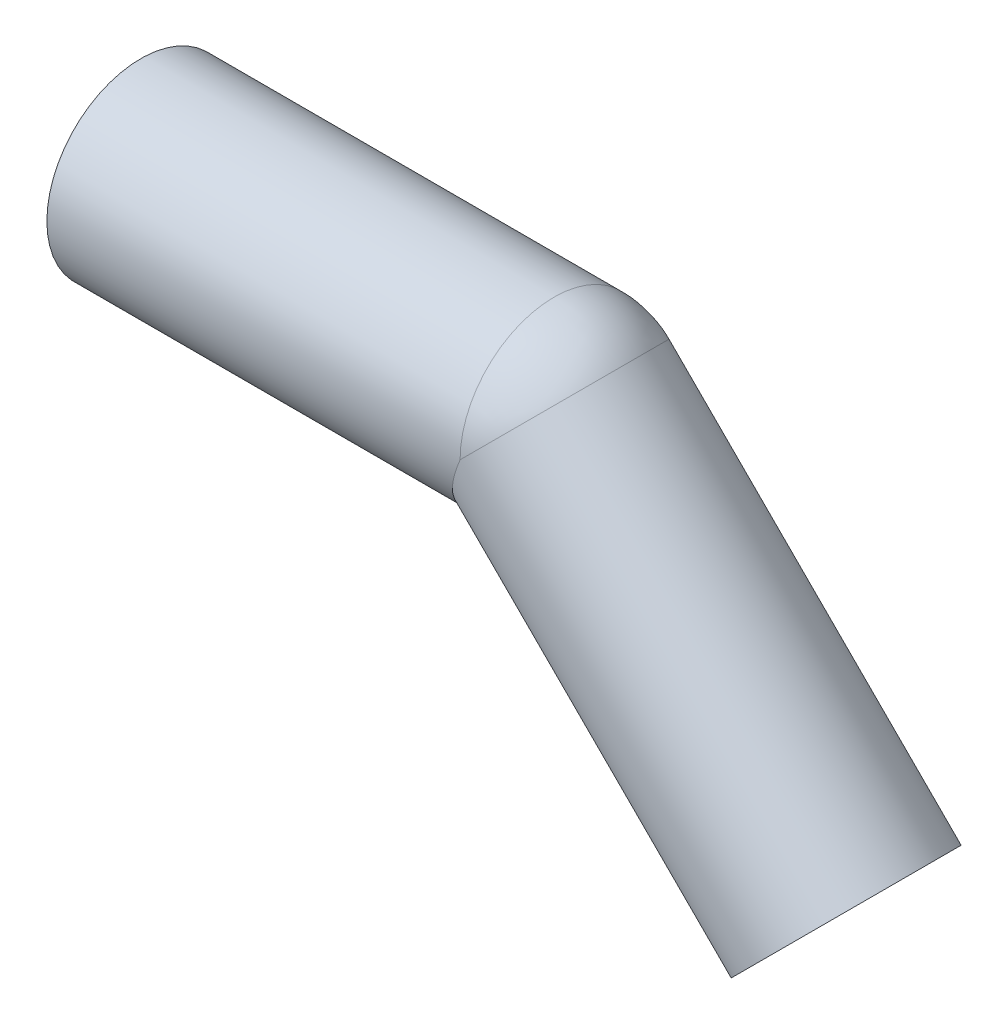
ISO-10303-21;
HEADER;
FILE_DESCRIPTION(('STEP AP214'),'2;1');
FILE_NAME('part.step','',(''),(''),'','','');
FILE_SCHEMA(('AUTOMOTIVE_DESIGN { 1 0 10303 214 1 1 1 1 }'));
ENDSEC;
DATA;
#1=APPLICATION_CONTEXT('core data for automotive mechanical design processes');
#2=APPLICATION_PROTOCOL_DEFINITION('international standard','automotive_design',2000,#1);
#3=PRODUCT_CONTEXT('',#1,'mechanical');
#4=PRODUCT('Part','Part','',(#3));
#5=PRODUCT_RELATED_PRODUCT_CATEGORY('part','',(#4));
#6=PRODUCT_DEFINITION_FORMATION('','',#4);
#7=PRODUCT_DEFINITION_CONTEXT('part definition',#1,'design');
#8=PRODUCT_DEFINITION('design','',#6,#7);
#9=PRODUCT_DEFINITION_SHAPE('','',#8);
#10=(LENGTH_UNIT() NAMED_UNIT(*) SI_UNIT(.MILLI.,.METRE.));
#11=(NAMED_UNIT(*) PLANE_ANGLE_UNIT() SI_UNIT($,.RADIAN.));
#12=(NAMED_UNIT(*) SI_UNIT($,.STERADIAN.) SOLID_ANGLE_UNIT());
#13=UNCERTAINTY_MEASURE_WITH_UNIT(LENGTH_MEASURE(1.E-05),#10,'distance_accuracy_value','');
#14=(GEOMETRIC_REPRESENTATION_CONTEXT(3) GLOBAL_UNCERTAINTY_ASSIGNED_CONTEXT((#13)) GLOBAL_UNIT_ASSIGNED_CONTEXT((#10,
#11,#12)) REPRESENTATION_CONTEXT('',''));
#15=CARTESIAN_POINT('',(0.,0.,0.));
#16=DIRECTION('',(0.,0.,1.));
#17=DIRECTION('',(1.,0.,0.));
#18=AXIS2_PLACEMENT_3D('',#15,#16,#17);
#19=CARTESIAN_POINT('',(75.1126983722081,-31.1126983722081,0.));
#20=DIRECTION('',(-0.707106781186548,0.707106781186547,0.));
#21=DIRECTION('',(-0.707106781186547,-0.707106781186548,0.));
#22=AXIS2_PLACEMENT_3D('',#19,#20,#21);
#23=CYLINDRICAL_SURFACE('',#22,8.10000000000003);
#24=CARTESIAN_POINT('',(44.,0.,0.));
#25=DIRECTION('',(0.707106781186547,-0.707106781186548,0.));
#26=DIRECTION('',(0.,0.,-1.));
#27=AXIS2_PLACEMENT_3D('',#24,#25,#26);
#28=CIRCLE('',#27,8.10000000000001);
#29=CARTESIAN_POINT('',(49.7275649276471,5.727564927575,0.));
#30=VERTEX_POINT('',#29);
#31=CARTESIAN_POINT('',(43.9999999999999,0.,8.10000000000002));
#32=VERTEX_POINT('',#31);
#33=EDGE_CURVE('E53',#30,#32,#28,.T.);
#34=ORIENTED_EDGE('',*,*,#33,.F.);
#35=CARTESIAN_POINT('',(44.,0.,0.));
#36=DIRECTION('',(0.707106781173201,-0.707106781199895,0.));
#37=DIRECTION('',(0.,0.,-1.));
#38=AXIS2_PLACEMENT_3D('',#35,#36,#37);
#39=CIRCLE('',#38,8.10000000000001);
#40=CARTESIAN_POINT('',(43.9999999999999,0.,-8.10000000000001));
#41=VERTEX_POINT('',#40);
#42=EDGE_CURVE('E46',#41,#30,#39,.T.);
#43=ORIENTED_EDGE('',*,*,#42,.F.);
#44=CARTESIAN_POINT('',(43.9999999999999,0.,0.));
#45=DIRECTION('',(-0.923879532511287,0.382683432365089,0.));
#46=DIRECTION('',(-0.382683432365089,-0.923879532511287,0.));
#47=AXIS2_PLACEMENT_3D('',#44,#45,#46);
#48=ELLIPSE('',#47,8.76737682236841,8.10000000000002);
#49=EDGE_CURVE('E55',#32,#41,#48,.F.);
#50=ORIENTED_EDGE('',*,*,#49,.F.);
#51=EDGE_LOOP('',(#34,#43,#50));
#52=FACE_BOUND('',#51,.T.);
#53=CARTESIAN_POINT('',(75.1126983722081,-31.1126983722081,0.));
#54=DIRECTION('',(-0.707106781186549,0.707106781186546,0.));
#55=DIRECTION('',(-0.707106781186546,-0.707106781186549,0.));
#56=AXIS2_PLACEMENT_3D('',#53,#54,#55);
#57=CIRCLE('',#56,8.10000000000003);
#58=CARTESIAN_POINT('',(69.385133444597,-36.8402632998192,0.));
#59=VERTEX_POINT('',#58);
#60=EDGE_CURVE('E18',#59,#59,#57,.T.);
#61=ORIENTED_EDGE('',*,*,#60,.F.);
#62=EDGE_LOOP('',(#61));
#63=FACE_BOUND('',#62,.T.);
#64=ADVANCED_FACE('F15',(#52,#63),#23,.F.);
#65=CARTESIAN_POINT('',(44.,0.,0.));
#66=DIRECTION('',(0.,0.,1.));
#67=DIRECTION('',(-1.,0.,0.));
#68=AXIS2_PLACEMENT_3D('',#65,#66,#67);
#69=SPHERICAL_SURFACE('',#68,8.10000000000001);
#70=CARTESIAN_POINT('',(44.,0.,0.));
#71=DIRECTION('',(-1.,0.,0.));
#72=DIRECTION('',(0.,1.,0.));
#73=AXIS2_PLACEMENT_3D('',#70,#71,#72);
#74=CIRCLE('',#73,8.1);
#75=EDGE_CURVE('E51',#41,#32,#74,.F.);
#76=ORIENTED_EDGE('',*,*,#75,.F.);
#77=ORIENTED_EDGE('',*,*,#42,.T.);
#78=ORIENTED_EDGE('',*,*,#33,.T.);
#79=EDGE_LOOP('',(#76,#77,#78));
#80=FACE_BOUND('',#79,.T.);
#81=ADVANCED_FACE('F58',(#80),#69,.F.);
#82=CARTESIAN_POINT('',(82.1837661840742,-24.041630560342,10.1200021082712));
#83=DIRECTION('',(0.707106781186547,-0.707106781186547,0.));
#84=DIRECTION('',(-0.707106781186547,-0.707106781186547,0.));
#85=AXIS2_PLACEMENT_3D('',#82,#83,#84);
#86=PLANE('',#85);
#87=ORIENTED_EDGE('',*,*,#60,.T.);
#88=EDGE_LOOP('',(#87));
#89=FACE_BOUND('',#88,.T.);
#90=CARTESIAN_POINT('',(75.1126983722082,-31.112698372208,0.));
#91=DIRECTION('',(-0.707106781186551,0.707106781186544,0.));
#92=DIRECTION('',(-0.707106781186544,-0.707106781186551,0.));
#93=AXIS2_PLACEMENT_3D('',#90,#91,#92);
#94=CIRCLE('',#93,10.);
#95=CARTESIAN_POINT('',(68.0416305603428,-38.1837661840736,0.));
#96=VERTEX_POINT('',#95);
#97=EDGE_CURVE('E71',#96,#96,#94,.T.);
#98=ORIENTED_EDGE('',*,*,#97,.F.);
#99=EDGE_LOOP('',(#98));
#100=FACE_BOUND('',#99,.T.);
#101=ADVANCED_FACE('F80',(#89,#100),#86,.T.);
#102=CARTESIAN_POINT('',(44.,0.,0.));
#103=DIRECTION('',(-1.,0.,0.));
#104=DIRECTION('',(0.,0.,1.));
#105=AXIS2_PLACEMENT_3D('',#102,#103,#104);
#106=CYLINDRICAL_SURFACE('',#105,8.1);
#107=CARTESIAN_POINT('',(0.,0.,0.));
#108=DIRECTION('',(-1.,0.,0.));
#109=DIRECTION('',(0.,0.,1.));
#110=AXIS2_PLACEMENT_3D('',#107,#108,#109);
#111=CIRCLE('',#110,8.1);
#112=CARTESIAN_POINT('',(0.,0.,8.1));
#113=VERTEX_POINT('',#112);
#114=EDGE_CURVE('E68',#113,#113,#111,.F.);
#115=ORIENTED_EDGE('',*,*,#114,.F.);
#116=EDGE_LOOP('',(#115));
#117=FACE_BOUND('',#116,.T.);
#118=ORIENTED_EDGE('',*,*,#49,.T.);
#119=ORIENTED_EDGE('',*,*,#75,.T.);
#120=EDGE_LOOP('',(#118,#119));
#121=FACE_BOUND('',#120,.T.);
#122=ADVANCED_FACE('F83',(#117,#121),#106,.F.);
#123=CARTESIAN_POINT('',(44.,0.,0.));
#124=DIRECTION('',(0.,0.,1.));
#125=DIRECTION('',(1.,0.,0.));
#126=AXIS2_PLACEMENT_3D('',#123,#124,#125);
#127=SPHERICAL_SURFACE('',#126,10.);
#128=CARTESIAN_POINT('',(44.,0.,0.));
#129=DIRECTION('',(-1.,0.,0.));
#130=DIRECTION('',(0.,1.,0.));
#131=AXIS2_PLACEMENT_3D('',#128,#129,#130);
#132=CIRCLE('',#131,10.);
#133=CARTESIAN_POINT('',(43.9999999999999,0.,10.));
#134=VERTEX_POINT('',#133);
#135=CARTESIAN_POINT('',(43.9999999999999,0.,-10.));
#136=VERTEX_POINT('',#135);
#137=EDGE_CURVE('E67',#134,#136,#132,.T.);
#138=ORIENTED_EDGE('',*,*,#137,.F.);
#139=CARTESIAN_POINT('',(44.,0.,0.));
#140=DIRECTION('',(-0.707106781178578,0.707106781194517,0.));
#141=DIRECTION('',(0.,0.,1.));
#142=AXIS2_PLACEMENT_3D('',#139,#140,#141);
#143=CIRCLE('',#142,10.);
#144=CARTESIAN_POINT('',(51.0710678119053,7.07106781182564,0.));
#145=VERTEX_POINT('',#144);
#146=EDGE_CURVE('E73',#134,#145,#143,.T.);
#147=ORIENTED_EDGE('',*,*,#146,.T.);
#148=CARTESIAN_POINT('',(43.9999999999999,0.,0.));
#149=DIRECTION('',(-0.707106781186551,0.707106781186544,0.));
#150=DIRECTION('',(0.707106781186544,0.707106781186551,0.));
#151=AXIS2_PLACEMENT_3D('',#148,#149,#150);
#152=CIRCLE('',#151,10.0000000000001);
#153=EDGE_CURVE('E33',#136,#145,#152,.F.);
#154=ORIENTED_EDGE('',*,*,#153,.F.);
#155=EDGE_LOOP('',(#138,#147,#154));
#156=FACE_BOUND('',#155,.T.);
#157=ADVANCED_FACE('F87',(#156),#127,.T.);
#158=CARTESIAN_POINT('',(43.9999999999999,0.,0.));
#159=DIRECTION('',(-0.707106781186551,0.707106781186544,0.));
#160=DIRECTION('',(-0.707106781186544,-0.707106781186551,0.));
#161=AXIS2_PLACEMENT_3D('',#158,#159,#160);
#162=CYLINDRICAL_SURFACE('',#161,10.);
#163=ORIENTED_EDGE('',*,*,#97,.T.);
#164=EDGE_LOOP('',(#163));
#165=FACE_BOUND('',#164,.T.);
#166=CARTESIAN_POINT('',(43.9999999999998,0.,0.));
#167=DIRECTION('',(-0.923879532511288,0.382683432365087,0.));
#168=DIRECTION('',(0.382683432365087,0.923879532511288,0.));
#169=AXIS2_PLACEMENT_3D('',#166,#167,#168);
#170=ELLIPSE('',#169,10.8239220029239,10.);
#171=EDGE_CURVE('E24',#136,#134,#170,.T.);
#172=ORIENTED_EDGE('',*,*,#171,.F.);
#173=ORIENTED_EDGE('',*,*,#153,.T.);
#174=ORIENTED_EDGE('',*,*,#146,.F.);
#175=EDGE_LOOP('',(#172,#173,#174));
#176=FACE_BOUND('',#175,.T.);
#177=ADVANCED_FACE('F91',(#165,#176),#162,.T.);
#178=CARTESIAN_POINT('',(0.,-10.,10.120002108255));
#179=DIRECTION('',(-1.,0.,0.));
#180=DIRECTION('',(0.,1.,0.));
#181=AXIS2_PLACEMENT_3D('',#178,#179,#180);
#182=PLANE('',#181);
#183=ORIENTED_EDGE('',*,*,#114,.T.);
#184=EDGE_LOOP('',(#183));
#185=FACE_BOUND('',#184,.T.);
#186=CARTESIAN_POINT('',(0.,0.,0.));
#187=DIRECTION('',(-1.,0.,0.));
#188=DIRECTION('',(0.,0.,1.));
#189=AXIS2_PLACEMENT_3D('',#186,#187,#188);
#190=CIRCLE('',#189,10.);
#191=CARTESIAN_POINT('',(0.,0.,10.));
#192=VERTEX_POINT('',#191);
#193=EDGE_CURVE('E9',#192,#192,#190,.F.);
#194=ORIENTED_EDGE('',*,*,#193,.F.);
#195=EDGE_LOOP('',(#194));
#196=FACE_BOUND('',#195,.T.);
#197=ADVANCED_FACE('F105',(#185,#196),#182,.T.);
#198=CARTESIAN_POINT('',(0.,0.,0.));
#199=DIRECTION('',(-1.,0.,0.));
#200=DIRECTION('',(0.,0.,1.));
#201=AXIS2_PLACEMENT_3D('',#198,#199,#200);
#202=CYLINDRICAL_SURFACE('',#201,10.);
#203=ORIENTED_EDGE('',*,*,#171,.T.);
#204=ORIENTED_EDGE('',*,*,#137,.T.);
#205=EDGE_LOOP('',(#203,#204));
#206=FACE_BOUND('',#205,.T.);
#207=ORIENTED_EDGE('',*,*,#193,.T.);
#208=EDGE_LOOP('',(#207));
#209=FACE_BOUND('',#208,.T.);
#210=ADVANCED_FACE('F102',(#206,#209),#202,.T.);
#211=CLOSED_SHELL('',(#64,#81,#101,#122,#157,#177,#197,#210));
#212=MANIFOLD_SOLID_BREP('B1',#211);
#213=ADVANCED_BREP_SHAPE_REPRESENTATION('',(#18,#212),#14);
#214=SHAPE_DEFINITION_REPRESENTATION(#9,#213);
ENDSEC;
END-ISO-10303-21;
